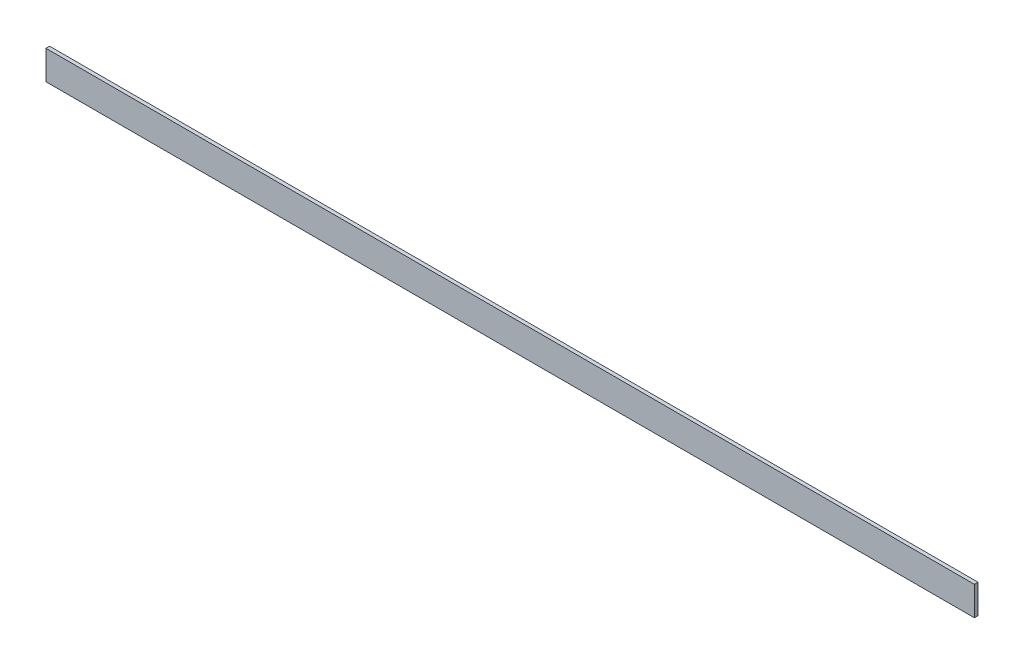
ISO-10303-21;
HEADER;
FILE_DESCRIPTION(('STEP AP214'),'2;1');
FILE_NAME('part.step','',(''),(''),'','','');
FILE_SCHEMA(('AUTOMOTIVE_DESIGN { 1 0 10303 214 1 1 1 1 }'));
ENDSEC;
DATA;
#1=APPLICATION_CONTEXT('core data for automotive mechanical design processes');
#2=APPLICATION_PROTOCOL_DEFINITION('international standard','automotive_design',2000,#1);
#3=PRODUCT_CONTEXT('',#1,'mechanical');
#4=PRODUCT('Part','Part','',(#3));
#5=PRODUCT_RELATED_PRODUCT_CATEGORY('part','',(#4));
#6=PRODUCT_DEFINITION_FORMATION('','',#4);
#7=PRODUCT_DEFINITION_CONTEXT('part definition',#1,'design');
#8=PRODUCT_DEFINITION('design','',#6,#7);
#9=PRODUCT_DEFINITION_SHAPE('','',#8);
#10=(LENGTH_UNIT() NAMED_UNIT(*) SI_UNIT(.MILLI.,.METRE.));
#11=(NAMED_UNIT(*) PLANE_ANGLE_UNIT() SI_UNIT($,.RADIAN.));
#12=(NAMED_UNIT(*) SI_UNIT($,.STERADIAN.) SOLID_ANGLE_UNIT());
#13=UNCERTAINTY_MEASURE_WITH_UNIT(LENGTH_MEASURE(1.E-05),#10,'distance_accuracy_value','');
#14=(GEOMETRIC_REPRESENTATION_CONTEXT(3) GLOBAL_UNCERTAINTY_ASSIGNED_CONTEXT((#13)) GLOBAL_UNIT_ASSIGNED_CONTEXT((#10,
#11,#12)) REPRESENTATION_CONTEXT('',''));
#15=CARTESIAN_POINT('',(0.,0.,0.));
#16=DIRECTION('',(0.,0.,1.));
#17=DIRECTION('',(1.,0.,0.));
#18=AXIS2_PLACEMENT_3D('',#15,#16,#17);
#19=CARTESIAN_POINT('',(0.,12.7,0.));
#20=DIRECTION('',(1.,0.,0.));
#21=DIRECTION('',(0.,0.,-1.));
#22=AXIS2_PLACEMENT_3D('',#19,#20,#21);
#23=PLANE('',#22);
#24=DIRECTION('',(0.,0.,1.));
#25=VECTOR('',#24,1.);
#26=CARTESIAN_POINT('',(0.,0.,0.));
#27=LINE('',#26,#25);
#28=CARTESIAN_POINT('',(0.,0.,-1.5875));
#29=VERTEX_POINT('',#28);
#30=CARTESIAN_POINT('',(0.,0.,0.));
#31=VERTEX_POINT('',#30);
#32=EDGE_CURVE('E96',#29,#31,#27,.T.);
#33=ORIENTED_EDGE('',*,*,#32,.T.);
#34=DIRECTION('',(0.,-1.,0.));
#35=VECTOR('',#34,1.);
#36=CARTESIAN_POINT('',(0.,12.7,0.));
#37=LINE('',#36,#35);
#38=CARTESIAN_POINT('',(0.,12.7,0.));
#39=VERTEX_POINT('',#38);
#40=EDGE_CURVE('E11',#39,#31,#37,.T.);
#41=ORIENTED_EDGE('',*,*,#40,.F.);
#42=DIRECTION('',(0.,0.,1.));
#43=VECTOR('',#42,1.);
#44=CARTESIAN_POINT('',(0.,12.7,0.));
#45=LINE('',#44,#43);
#46=CARTESIAN_POINT('',(0.,12.7,-1.5875));
#47=VERTEX_POINT('',#46);
#48=EDGE_CURVE('E84',#47,#39,#45,.T.);
#49=ORIENTED_EDGE('',*,*,#48,.F.);
#50=DIRECTION('',(0.,-1.,0.));
#51=VECTOR('',#50,1.);
#52=CARTESIAN_POINT('',(0.,12.7,-1.5875));
#53=LINE('',#52,#51);
#54=EDGE_CURVE('E92',#47,#29,#53,.T.);
#55=ORIENTED_EDGE('',*,*,#54,.T.);
#56=EDGE_LOOP('',(#33,#41,#49,#55));
#57=FACE_BOUND('',#56,.T.);
#58=ADVANCED_FACE('F33',(#57),#23,.F.);
#59=CARTESIAN_POINT('',(0.,12.7,0.));
#60=DIRECTION('',(0.,0.,-1.));
#61=DIRECTION('',(-1.,0.,0.));
#62=AXIS2_PLACEMENT_3D('',#59,#60,#61);
#63=PLANE('',#62);
#64=DIRECTION('',(1.,0.,0.));
#65=VECTOR('',#64,1.);
#66=CARTESIAN_POINT('',(0.,0.,0.));
#67=LINE('',#66,#65);
#68=CARTESIAN_POINT('',(406.4,0.,0.));
#69=VERTEX_POINT('',#68);
#70=EDGE_CURVE('E88',#31,#69,#67,.T.);
#71=ORIENTED_EDGE('',*,*,#70,.T.);
#72=DIRECTION('',(0.,-1.,0.));
#73=VECTOR('',#72,1.);
#74=CARTESIAN_POINT('',(406.4,12.7,0.));
#75=LINE('',#74,#73);
#76=CARTESIAN_POINT('',(406.4,12.7,0.));
#77=VERTEX_POINT('',#76);
#78=EDGE_CURVE('E41',#77,#69,#75,.T.);
#79=ORIENTED_EDGE('',*,*,#78,.F.);
#80=DIRECTION('',(1.,0.,0.));
#81=VECTOR('',#80,1.);
#82=CARTESIAN_POINT('',(0.,12.7,0.));
#83=LINE('',#82,#81);
#84=EDGE_CURVE('E79',#39,#77,#83,.T.);
#85=ORIENTED_EDGE('',*,*,#84,.F.);
#86=ORIENTED_EDGE('',*,*,#40,.T.);
#87=EDGE_LOOP('',(#71,#79,#85,#86));
#88=FACE_BOUND('',#87,.T.);
#89=ADVANCED_FACE('F87',(#88),#63,.F.);
#90=CARTESIAN_POINT('',(406.4,12.7,0.));
#91=DIRECTION('',(-1.,0.,0.));
#92=DIRECTION('',(0.,0.,1.));
#93=AXIS2_PLACEMENT_3D('',#90,#91,#92);
#94=PLANE('',#93);
#95=DIRECTION('',(0.,0.,-1.));
#96=VECTOR('',#95,1.);
#97=CARTESIAN_POINT('',(406.4,0.,0.));
#98=LINE('',#97,#96);
#99=CARTESIAN_POINT('',(406.4,0.,-1.5875));
#100=VERTEX_POINT('',#99);
#101=EDGE_CURVE('E66',#69,#100,#98,.T.);
#102=ORIENTED_EDGE('',*,*,#101,.T.);
#103=DIRECTION('',(0.,-1.,0.));
#104=VECTOR('',#103,1.);
#105=CARTESIAN_POINT('',(406.4,12.7,-1.5875));
#106=LINE('',#105,#104);
#107=CARTESIAN_POINT('',(406.4,12.7,-1.5875));
#108=VERTEX_POINT('',#107);
#109=EDGE_CURVE('E89',#108,#100,#106,.T.);
#110=ORIENTED_EDGE('',*,*,#109,.F.);
#111=DIRECTION('',(0.,0.,-1.));
#112=VECTOR('',#111,1.);
#113=CARTESIAN_POINT('',(406.4,12.7,0.));
#114=LINE('',#113,#112);
#115=EDGE_CURVE('E82',#77,#108,#114,.T.);
#116=ORIENTED_EDGE('',*,*,#115,.F.);
#117=ORIENTED_EDGE('',*,*,#78,.T.);
#118=EDGE_LOOP('',(#102,#110,#116,#117));
#119=FACE_BOUND('',#118,.T.);
#120=ADVANCED_FACE('F90',(#119),#94,.F.);
#121=CARTESIAN_POINT('',(0.,12.7,-1.5875));
#122=DIRECTION('',(0.,0.,1.));
#123=DIRECTION('',(1.,0.,0.));
#124=AXIS2_PLACEMENT_3D('',#121,#122,#123);
#125=PLANE('',#124);
#126=DIRECTION('',(-1.,0.,0.));
#127=VECTOR('',#126,1.);
#128=CARTESIAN_POINT('',(0.,0.,-1.5875));
#129=LINE('',#128,#127);
#130=EDGE_CURVE('E72',#100,#29,#129,.T.);
#131=ORIENTED_EDGE('',*,*,#130,.T.);
#132=ORIENTED_EDGE('',*,*,#54,.F.);
#133=DIRECTION('',(-1.,0.,0.));
#134=VECTOR('',#133,1.);
#135=CARTESIAN_POINT('',(0.,12.7,-1.5875));
#136=LINE('',#135,#134);
#137=EDGE_CURVE('E49',#108,#47,#136,.T.);
#138=ORIENTED_EDGE('',*,*,#137,.F.);
#139=ORIENTED_EDGE('',*,*,#109,.T.);
#140=EDGE_LOOP('',(#131,#132,#138,#139));
#141=FACE_BOUND('',#140,.T.);
#142=ADVANCED_FACE('F103',(#141),#125,.F.);
#143=CARTESIAN_POINT('',(0.,12.7,0.));
#144=DIRECTION('',(0.,-1.,0.));
#145=DIRECTION('',(0.,0.,-1.));
#146=AXIS2_PLACEMENT_3D('',#143,#144,#145);
#147=PLANE('',#146);
#148=ORIENTED_EDGE('',*,*,#48,.T.);
#149=ORIENTED_EDGE('',*,*,#84,.T.);
#150=ORIENTED_EDGE('',*,*,#115,.T.);
#151=ORIENTED_EDGE('',*,*,#137,.T.);
#152=EDGE_LOOP('',(#148,#149,#150,#151));
#153=FACE_BOUND('',#152,.T.);
#154=ADVANCED_FACE('F80',(#153),#147,.F.);
#155=CARTESIAN_POINT('',(0.,0.,0.));
#156=DIRECTION('',(0.,-1.,0.));
#157=DIRECTION('',(0.,0.,-1.));
#158=AXIS2_PLACEMENT_3D('',#155,#156,#157);
#159=PLANE('',#158);
#160=ORIENTED_EDGE('',*,*,#32,.F.);
#161=ORIENTED_EDGE('',*,*,#130,.F.);
#162=ORIENTED_EDGE('',*,*,#101,.F.);
#163=ORIENTED_EDGE('',*,*,#70,.F.);
#164=EDGE_LOOP('',(#160,#161,#162,#163));
#165=FACE_BOUND('',#164,.T.);
#166=ADVANCED_FACE('F106',(#165),#159,.T.);
#167=CLOSED_SHELL('',(#58,#89,#120,#142,#154,#166));
#168=MANIFOLD_SOLID_BREP('B2',#167);
#169=ADVANCED_BREP_SHAPE_REPRESENTATION('',(#18,#168),#14);
#170=SHAPE_DEFINITION_REPRESENTATION(#9,#169);
ENDSEC;
END-ISO-10303-21;
